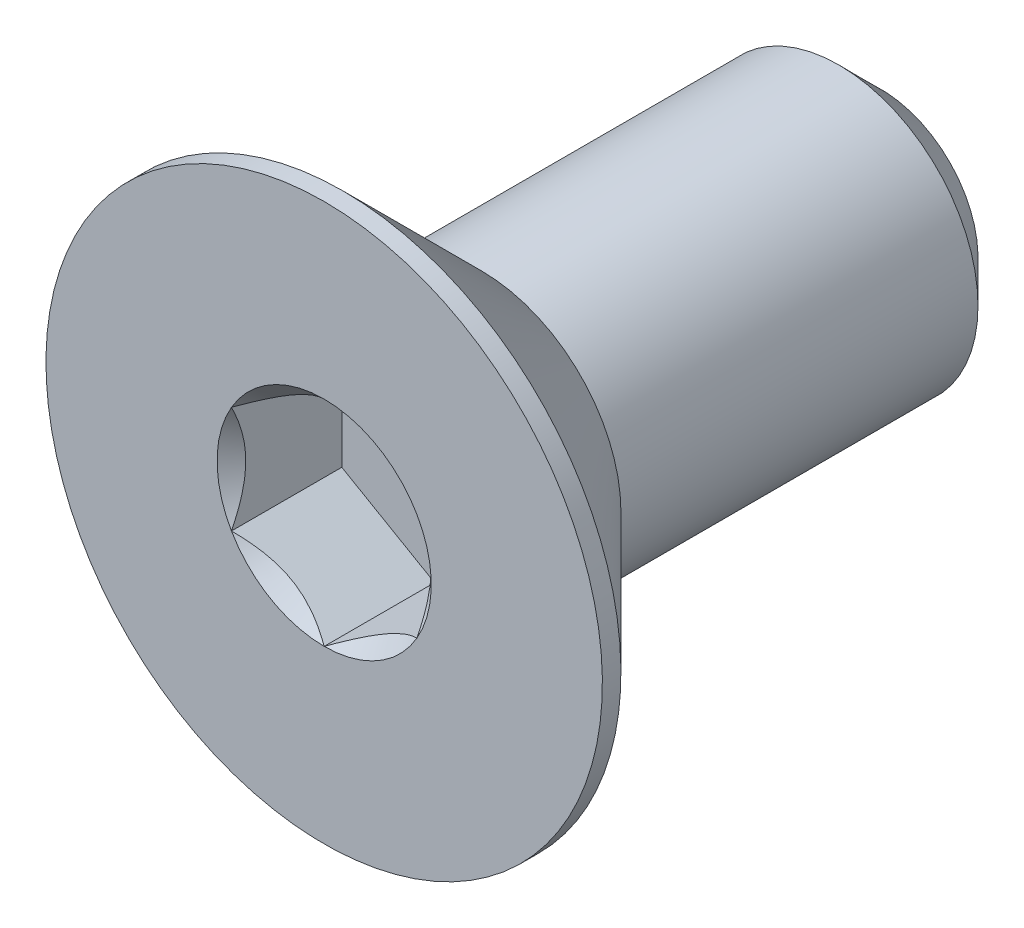
ISO-10303-21;
HEADER;
FILE_DESCRIPTION(('STEP AP214'),'2;1');
FILE_NAME('part.step','',(''),(''),'','','');
FILE_SCHEMA(('AUTOMOTIVE_DESIGN { 1 0 10303 214 1 1 1 1 }'));
ENDSEC;
DATA;
#1=APPLICATION_CONTEXT('core data for automotive mechanical design processes');
#2=APPLICATION_PROTOCOL_DEFINITION('international standard','automotive_design',2000,#1);
#3=PRODUCT_CONTEXT('',#1,'mechanical');
#4=PRODUCT('Part','Part','',(#3));
#5=PRODUCT_RELATED_PRODUCT_CATEGORY('part','',(#4));
#6=PRODUCT_DEFINITION_FORMATION('','',#4);
#7=PRODUCT_DEFINITION_CONTEXT('part definition',#1,'design');
#8=PRODUCT_DEFINITION('design','',#6,#7);
#9=PRODUCT_DEFINITION_SHAPE('','',#8);
#10=(LENGTH_UNIT() NAMED_UNIT(*) SI_UNIT(.MILLI.,.METRE.));
#11=(NAMED_UNIT(*) PLANE_ANGLE_UNIT() SI_UNIT($,.RADIAN.));
#12=(NAMED_UNIT(*) SI_UNIT($,.STERADIAN.) SOLID_ANGLE_UNIT());
#13=UNCERTAINTY_MEASURE_WITH_UNIT(LENGTH_MEASURE(1.E-05),#10,'distance_accuracy_value','');
#14=(GEOMETRIC_REPRESENTATION_CONTEXT(3) GLOBAL_UNCERTAINTY_ASSIGNED_CONTEXT((#13)) GLOBAL_UNIT_ASSIGNED_CONTEXT((#10,
#11,#12)) REPRESENTATION_CONTEXT('',''));
#15=CARTESIAN_POINT('',(0.,0.,0.));
#16=DIRECTION('',(0.,0.,1.));
#17=DIRECTION('',(1.,0.,0.));
#18=AXIS2_PLACEMENT_3D('',#15,#16,#17);
#19=CARTESIAN_POINT('',(0.,0.,-3.));
#20=DIRECTION('',(0.,0.,-1.));
#21=DIRECTION('',(0.,1.,0.));
#22=AXIS2_PLACEMENT_3D('',#19,#20,#21);
#23=CYLINDRICAL_SURFACE('',#22,1.5);
#24=CARTESIAN_POINT('',(0.,0.,1.3));
#25=DIRECTION('',(0.,0.,-1.));
#26=DIRECTION('',(0.,1.,0.));
#27=AXIS2_PLACEMENT_3D('',#24,#25,#26);
#28=CIRCLE('',#27,1.5);
#29=CARTESIAN_POINT('',(0.,1.5,1.3));
#30=VERTEX_POINT('',#29);
#31=EDGE_CURVE('E11',#30,#30,#28,.F.);
#32=ORIENTED_EDGE('',*,*,#31,.F.);
#33=EDGE_LOOP('',(#32));
#34=FACE_BOUND('',#33,.T.);
#35=CARTESIAN_POINT('',(0.,0.,-2.55));
#36=DIRECTION('',(0.,0.,-1.));
#37=DIRECTION('',(0.,1.,0.));
#38=AXIS2_PLACEMENT_3D('',#35,#36,#37);
#39=CIRCLE('',#38,1.5);
#40=CARTESIAN_POINT('',(0.,-1.5,-2.55));
#41=VERTEX_POINT('',#40);
#42=EDGE_CURVE('E43',#41,#41,#39,.F.);
#43=ORIENTED_EDGE('',*,*,#42,.T.);
#44=EDGE_LOOP('',(#43));
#45=FACE_BOUND('',#44,.T.);
#46=ADVANCED_FACE('F35',(#34,#45),#23,.T.);
#47=CARTESIAN_POINT('',(0.,1.5,-3.));
#48=DIRECTION('',(0.,0.,-1.));
#49=DIRECTION('',(0.,1.,0.));
#50=AXIS2_PLACEMENT_3D('',#47,#48,#49);
#51=PLANE('',#50);
#52=CARTESIAN_POINT('',(0.,0.,-3.));
#53=DIRECTION('',(0.,0.,-1.));
#54=DIRECTION('',(0.,1.,0.));
#55=AXIS2_PLACEMENT_3D('',#52,#53,#54);
#56=CIRCLE('',#55,1.05);
#57=CARTESIAN_POINT('',(0.,-1.05,-3.));
#58=VERTEX_POINT('',#57);
#59=EDGE_CURVE('E147',#58,#58,#56,.T.);
#60=ORIENTED_EDGE('',*,*,#59,.T.);
#61=EDGE_LOOP('',(#60));
#62=FACE_BOUND('',#61,.T.);
#63=ADVANCED_FACE('F156',(#62),#51,.T.);
#64=CARTESIAN_POINT('',(0.,0.,-3.));
#65=DIRECTION('',(0.,0.,1.));
#66=DIRECTION('',(0.,-1.,0.));
#67=AXIS2_PLACEMENT_3D('',#64,#65,#66);
#68=CONICAL_SURFACE('',#67,1.05,0.785398163397447);
#69=CARTESIAN_POINT('',(0.,-1.5,-2.55));
#70=CARTESIAN_POINT('',(0.,-1.4953125,-2.5546875));
#71=CARTESIAN_POINT('',(0.,-1.490625,-2.559375));
#72=CARTESIAN_POINT('',(0.,-1.48125,-2.56875));
#73=CARTESIAN_POINT('',(0.,-1.4765625,-2.5734375));
#74=CARTESIAN_POINT('',(0.,-1.4671875,-2.5828125));
#75=CARTESIAN_POINT('',(0.,-1.4625,-2.5875));
#76=CARTESIAN_POINT('',(0.,-1.453125,-2.596875));
#77=CARTESIAN_POINT('',(0.,-1.4484375,-2.6015625));
#78=CARTESIAN_POINT('',(0.,-1.4390625,-2.6109375));
#79=CARTESIAN_POINT('',(0.,-1.434375,-2.615625));
#80=CARTESIAN_POINT('',(0.,-1.425,-2.625));
#81=CARTESIAN_POINT('',(0.,-1.4203125,-2.6296875));
#82=CARTESIAN_POINT('',(0.,-1.4109375,-2.6390625));
#83=CARTESIAN_POINT('',(0.,-1.40625,-2.64375));
#84=CARTESIAN_POINT('',(0.,-1.396875,-2.653125));
#85=CARTESIAN_POINT('',(0.,-1.3921875,-2.6578125));
#86=CARTESIAN_POINT('',(0.,-1.3828125,-2.6671875));
#87=CARTESIAN_POINT('',(0.,-1.378125,-2.671875));
#88=CARTESIAN_POINT('',(0.,-1.36875,-2.68125));
#89=CARTESIAN_POINT('',(0.,-1.3640625,-2.6859375));
#90=CARTESIAN_POINT('',(0.,-1.3546875,-2.6953125));
#91=CARTESIAN_POINT('',(0.,-1.35,-2.7));
#92=CARTESIAN_POINT('',(0.,-1.340625,-2.709375));
#93=CARTESIAN_POINT('',(0.,-1.3359375,-2.7140625));
#94=CARTESIAN_POINT('',(0.,-1.3265625,-2.7234375));
#95=CARTESIAN_POINT('',(0.,-1.321875,-2.728125));
#96=CARTESIAN_POINT('',(0.,-1.3125,-2.7375));
#97=CARTESIAN_POINT('',(0.,-1.3078125,-2.7421875));
#98=CARTESIAN_POINT('',(0.,-1.2984375,-2.7515625));
#99=CARTESIAN_POINT('',(0.,-1.29375,-2.75625));
#100=CARTESIAN_POINT('',(0.,-1.284375,-2.765625));
#101=CARTESIAN_POINT('',(0.,-1.2796875,-2.7703125));
#102=CARTESIAN_POINT('',(0.,-1.2703125,-2.7796875));
#103=CARTESIAN_POINT('',(0.,-1.265625,-2.784375));
#104=CARTESIAN_POINT('',(0.,-1.25625,-2.79375));
#105=CARTESIAN_POINT('',(0.,-1.2515625,-2.7984375));
#106=CARTESIAN_POINT('',(0.,-1.2421875,-2.8078125));
#107=CARTESIAN_POINT('',(0.,-1.2375,-2.8125));
#108=CARTESIAN_POINT('',(0.,-1.228125,-2.821875));
#109=CARTESIAN_POINT('',(0.,-1.2234375,-2.8265625));
#110=CARTESIAN_POINT('',(0.,-1.2140625,-2.8359375));
#111=CARTESIAN_POINT('',(0.,-1.209375,-2.840625));
#112=CARTESIAN_POINT('',(0.,-1.2,-2.85));
#113=CARTESIAN_POINT('',(0.,-1.1953125,-2.8546875));
#114=CARTESIAN_POINT('',(0.,-1.1859375,-2.8640625));
#115=CARTESIAN_POINT('',(0.,-1.18125,-2.86875));
#116=CARTESIAN_POINT('',(0.,-1.171875,-2.878125));
#117=CARTESIAN_POINT('',(0.,-1.1671875,-2.8828125));
#118=CARTESIAN_POINT('',(0.,-1.1578125,-2.8921875));
#119=CARTESIAN_POINT('',(0.,-1.153125,-2.896875));
#120=CARTESIAN_POINT('',(0.,-1.14375,-2.90625));
#121=CARTESIAN_POINT('',(0.,-1.1390625,-2.9109375));
#122=CARTESIAN_POINT('',(0.,-1.1296875,-2.9203125));
#123=CARTESIAN_POINT('',(0.,-1.125,-2.925));
#124=CARTESIAN_POINT('',(0.,-1.115625,-2.934375));
#125=CARTESIAN_POINT('',(0.,-1.1109375,-2.9390625));
#126=CARTESIAN_POINT('',(0.,-1.1015625,-2.9484375));
#127=CARTESIAN_POINT('',(0.,-1.096875,-2.953125));
#128=CARTESIAN_POINT('',(0.,-1.0875,-2.9625));
#129=CARTESIAN_POINT('',(0.,-1.0828125,-2.9671875));
#130=CARTESIAN_POINT('',(0.,-1.0734375,-2.9765625));
#131=CARTESIAN_POINT('',(0.,-1.06875,-2.98125));
#132=CARTESIAN_POINT('',(0.,-1.059375,-2.990625));
#133=CARTESIAN_POINT('',(0.,-1.0546875,-2.9953125));
#134=CARTESIAN_POINT('',(0.,-1.05,-3.));
#135=B_SPLINE_CURVE_WITH_KNOTS('',3,(#69,#70,#71,#72,#73,#74,#75,#76,#77,#78,#79,#80,#81,#82,
#83,#84,#85,#86,#87,#88,#89,#90,#91,#92,#93,#94,#95,#96,#97,#98,#99,#100,#101,#102,#103,#104,
#105,#106,#107,#108,#109,#110,#111,#112,#113,#114,#115,#116,#117,#118,#119,#120,#121,#122,#123,
#124,#125,#126,#127,#128,#129,#130,#131,#132,#133,#134),.UNSPECIFIED.,.F.,.F.,(4,2,2,2,2,2,2,2,
2,2,2,2,2,2,2,2,2,2,2,2,2,2,2,2,2,2,2,2,2,2,2,2,4),(0.,0.0198873782208715,0.0397747564417434,
0.0596621346626151,0.079549512883487,0.0994368911043588,0.119324269325231,0.139211647546102,
0.159099025766974,0.178986403987846,0.198873782208718,0.218761160429589,0.238648538650461,
0.258535916871333,0.278423295092205,0.298310673313076,0.318198051533948,0.33808542975482,
0.357972807975692,0.377860186196563,0.397747564417435,0.417634942638307,0.437522320859179,
0.457409699080051,0.477297077300922,0.497184455521794,0.517071833742666,0.536959211963538,
0.556846590184409,0.576733968405281,0.596621346626153,0.616508724847025,0.636396103067896),.UNSPECIFIED.);
#136=EDGE_CURVE('BSEAM37',#41,#58,#135,.T.);
#137=ORIENTED_EDGE('',*,*,#42,.F.);
#138=ORIENTED_EDGE('',*,*,#59,.F.);
#139=ORIENTED_EDGE('',*,*,#136,.T.);
#140=ORIENTED_EDGE('',*,*,#136,.F.);
#141=EDGE_LOOP('',(#137,#139,#138,#140));
#142=FACE_BOUND('',#141,.T.);
#143=ADVANCED_FACE('F37',(#142),#68,.T.);
#144=CARTESIAN_POINT('',(0.,0.,-3.));
#145=DIRECTION('',(0.,0.,-1.));
#146=DIRECTION('',(0.,1.,0.));
#147=AXIS2_PLACEMENT_3D('',#144,#145,#146);
#148=CYLINDRICAL_SURFACE('',#147,3.);
#149=CARTESIAN_POINT('',(0.,0.,3.));
#150=DIRECTION('',(0.,0.,-1.));
#151=DIRECTION('',(0.,1.,0.));
#152=AXIS2_PLACEMENT_3D('',#149,#150,#151);
#153=CIRCLE('',#152,3.);
#154=CARTESIAN_POINT('',(0.,3.,3.));
#155=VERTEX_POINT('',#154);
#156=EDGE_CURVE('E127',#155,#155,#153,.T.);
#157=ORIENTED_EDGE('',*,*,#156,.T.);
#158=EDGE_LOOP('',(#157));
#159=FACE_BOUND('',#158,.T.);
#160=CARTESIAN_POINT('',(0.,0.,2.79999999999999));
#161=DIRECTION('',(0.,0.,-1.));
#162=DIRECTION('',(0.,1.,0.));
#163=AXIS2_PLACEMENT_3D('',#160,#161,#162);
#164=CIRCLE('',#163,3.);
#165=CARTESIAN_POINT('',(0.,3.,2.79999999999999));
#166=VERTEX_POINT('',#165);
#167=EDGE_CURVE('E124',#166,#166,#164,.T.);
#168=ORIENTED_EDGE('',*,*,#167,.F.);
#169=EDGE_LOOP('',(#168));
#170=FACE_BOUND('',#169,.T.);
#171=ADVANCED_FACE('F155',(#159,#170),#148,.T.);
#172=CARTESIAN_POINT('',(0.,0.,1.3));
#173=DIRECTION('',(0.,0.,1.));
#174=DIRECTION('',(0.,-1.,0.));
#175=AXIS2_PLACEMENT_3D('',#172,#173,#174);
#176=CONICAL_SURFACE('',#175,1.5,0.78539816339745);
#177=ORIENTED_EDGE('',*,*,#167,.T.);
#178=EDGE_LOOP('',(#177));
#179=FACE_BOUND('',#178,.T.);
#180=ORIENTED_EDGE('',*,*,#31,.T.);
#181=EDGE_LOOP('',(#180));
#182=FACE_BOUND('',#181,.T.);
#183=ADVANCED_FACE('F169',(#179,#182),#176,.T.);
#184=CARTESIAN_POINT('',(0.,0.,3.));
#185=DIRECTION('',(0.,0.,1.));
#186=DIRECTION('',(0.,-1.,0.));
#187=AXIS2_PLACEMENT_3D('',#184,#185,#186);
#188=PLANE('',#187);
#189=CARTESIAN_POINT('',(0.,0.,3.));
#190=DIRECTION('',(0.,0.,1.));
#191=DIRECTION('',(1.,0.,0.));
#192=AXIS2_PLACEMENT_3D('',#189,#190,#191);
#193=CIRCLE('',#192,1.15470053837925);
#194=CARTESIAN_POINT('',(1.,0.577350269189632,3.));
#195=VERTEX_POINT('',#194);
#196=CARTESIAN_POINT('',(0.,1.15470053837926,3.));
#197=VERTEX_POINT('',#196);
#198=EDGE_CURVE('E94',#195,#197,#193,.T.);
#199=ORIENTED_EDGE('',*,*,#198,.F.);
#200=CARTESIAN_POINT('',(0.,0.,3.));
#201=DIRECTION('',(0.,0.,1.));
#202=DIRECTION('',(1.,0.,0.));
#203=AXIS2_PLACEMENT_3D('',#200,#201,#202);
#204=CIRCLE('',#203,1.15470053837925);
#205=CARTESIAN_POINT('',(0.999999999999989,-0.577350269189633,3.));
#206=VERTEX_POINT('',#205);
#207=EDGE_CURVE('E106',#206,#195,#204,.T.);
#208=ORIENTED_EDGE('',*,*,#207,.F.);
#209=CARTESIAN_POINT('',(0.,0.,3.));
#210=DIRECTION('',(0.,0.,1.));
#211=DIRECTION('',(1.,0.,0.));
#212=AXIS2_PLACEMENT_3D('',#209,#210,#211);
#213=CIRCLE('',#212,1.15470053837925);
#214=CARTESIAN_POINT('',(0.,-1.15470053837924,3.));
#215=VERTEX_POINT('',#214);
#216=EDGE_CURVE('E240',#215,#206,#213,.T.);
#217=ORIENTED_EDGE('',*,*,#216,.F.);
#218=CARTESIAN_POINT('',(0.,0.,3.));
#219=DIRECTION('',(0.,0.,1.));
#220=DIRECTION('',(1.,0.,0.));
#221=AXIS2_PLACEMENT_3D('',#218,#219,#220);
#222=CIRCLE('',#221,1.15470053837925);
#223=CARTESIAN_POINT('',(-1.,-0.577350269189614,3.));
#224=VERTEX_POINT('',#223);
#225=EDGE_CURVE('E119',#224,#215,#222,.T.);
#226=ORIENTED_EDGE('',*,*,#225,.F.);
#227=CARTESIAN_POINT('',(0.,0.,3.));
#228=DIRECTION('',(0.,0.,1.));
#229=DIRECTION('',(1.,0.,0.));
#230=AXIS2_PLACEMENT_3D('',#227,#228,#229);
#231=CIRCLE('',#230,1.15470053837925);
#232=CARTESIAN_POINT('',(-1.,0.577350269189624,3.));
#233=VERTEX_POINT('',#232);
#234=EDGE_CURVE('E241',#233,#224,#231,.T.);
#235=ORIENTED_EDGE('',*,*,#234,.F.);
#236=CARTESIAN_POINT('',(0.,0.,3.));
#237=DIRECTION('',(0.,0.,1.));
#238=DIRECTION('',(1.,0.,0.));
#239=AXIS2_PLACEMENT_3D('',#236,#237,#238);
#240=CIRCLE('',#239,1.15470053837925);
#241=EDGE_CURVE('E109',#197,#233,#240,.T.);
#242=ORIENTED_EDGE('',*,*,#241,.F.);
#243=EDGE_LOOP('',(#199,#208,#217,#226,#235,#242));
#244=FACE_BOUND('',#243,.T.);
#245=ORIENTED_EDGE('',*,*,#156,.F.);
#246=EDGE_LOOP('',(#245));
#247=FACE_BOUND('',#246,.T.);
#248=ADVANCED_FACE('F103',(#244,#247),#188,.T.);
#249=CARTESIAN_POINT('',(1.,0.577350269189626,1.81));
#250=DIRECTION('',(0.5,0.866025403784438,0.));
#251=DIRECTION('',(-0.866025403784439,0.5,0.));
#252=AXIS2_PLACEMENT_3D('',#249,#250,#251);
#253=PLANE('',#252);
#254=DIRECTION('',(0.,0.,1.));
#255=VECTOR('',#254,1.);
#256=CARTESIAN_POINT('',(1.,0.577350269189626,1.81));
#257=LINE('',#256,#255);
#258=CARTESIAN_POINT('',(1.,0.577350269189626,1.81));
#259=VERTEX_POINT('',#258);
#260=EDGE_CURVE('E50',#259,#195,#257,.T.);
#261=ORIENTED_EDGE('',*,*,#260,.T.);
#262=CARTESIAN_POINT('',(-0.000199999999999771,1.15481600843309,3.00011548737261));
#263=CARTESIAN_POINT('',(0.0341825950071806,1.13496520795026,2.98027793082573));
#264=CARTESIAN_POINT('',(0.0691401181398245,1.11478247255942,2.96160502063888));
#265=CARTESIAN_POINT('',(0.140422802956089,1.07362739529219,2.92741474272315));
#266=CARTESIAN_POINT('',(0.176754750528983,1.0526511355808,2.91191640902345));
#267=CARTESIAN_POINT('',(0.25001661380331,1.01035337909803,2.88536730714226));
#268=CARTESIAN_POINT('',(0.286927851445413,0.989042666109242,2.87424977399692));
#269=CARTESIAN_POINT('',(0.361562729310857,0.945952199282693,2.85711986577618));
#270=CARTESIAN_POINT('',(0.399284088108633,0.924173762626598,2.85109469746667));
#271=CARTESIAN_POINT('',(0.464292198417931,0.886641312640017,2.84566055496749));
#272=CARTESIAN_POINT('',(0.491494371528169,0.870936130672278,2.84485693831673));
#273=CARTESIAN_POINT('',(0.545846040669108,0.839556179862851,2.84620669941688));
#274=CARTESIAN_POINT('',(0.572995523754872,0.823881418494926,2.84836072954719));
#275=CARTESIAN_POINT('',(0.654056277326956,0.77708097059937,2.85911697212847));
#276=CARTESIAN_POINT('',(0.707564140978423,0.746188191116433,2.87201455641535));
#277=CARTESIAN_POINT('',(0.801476065143427,0.691968116419652,2.90314073060217));
#278=CARTESIAN_POINT('',(0.842320523671831,0.668386557293374,2.91973779770183));
#279=CARTESIAN_POINT('',(0.922409637381942,0.622147085933683,2.95712492468529));
#280=CARTESIAN_POINT('',(0.961659010870436,0.599486449584576,2.9779013418174));
#281=CARTESIAN_POINT('',(1.0002,0.577234799135789,3.00011548737261));
#282=B_SPLINE_CURVE_WITH_KNOTS('',3,(#262,#263,#264,#265,#266,#267,#268,#269,#270,#271,#272,
#273,#274,#275,#276,#277,#278,#279,#280,#281),.UNSPECIFIED.,.F.,.F.,(4,2,2,2,2,2,2,2,2,4),(0.,
0.133237676828558,0.267252229834488,0.399137076269297,0.530689603280765,0.624814864263842,
0.718960890149128,0.907306626112091,1.05710100361789,1.20641411519286),.UNSPECIFIED.);
#283=EDGE_CURVE('E91',#197,#195,#282,.T.);
#284=ORIENTED_EDGE('',*,*,#283,.F.);
#285=DIRECTION('',(0.,0.,1.));
#286=VECTOR('',#285,1.);
#287=CARTESIAN_POINT('',(0.,1.15470053837925,1.81));
#288=LINE('',#287,#286);
#289=CARTESIAN_POINT('',(0.,1.15470053837925,1.81));
#290=VERTEX_POINT('',#289);
#291=EDGE_CURVE('E143',#290,#197,#288,.T.);
#292=ORIENTED_EDGE('',*,*,#291,.F.);
#293=DIRECTION('',(-0.866025403784439,0.5,0.));
#294=VECTOR('',#293,1.);
#295=CARTESIAN_POINT('',(1.,0.577350269189626,1.81));
#296=LINE('',#295,#294);
#297=EDGE_CURVE('E116',#259,#290,#296,.T.);
#298=ORIENTED_EDGE('',*,*,#297,.F.);
#299=EDGE_LOOP('',(#261,#284,#292,#298));
#300=FACE_BOUND('',#299,.T.);
#301=ADVANCED_FACE('F121',(#300),#253,.F.);
#302=CARTESIAN_POINT('',(1.,-0.577350269189627,1.81));
#303=DIRECTION('',(1.,0.,0.));
#304=DIRECTION('',(0.,0.,-1.));
#305=AXIS2_PLACEMENT_3D('',#302,#303,#304);
#306=PLANE('',#305);
#307=DIRECTION('',(0.,0.,1.));
#308=VECTOR('',#307,1.);
#309=CARTESIAN_POINT('',(1.,-0.577350269189627,1.81));
#310=LINE('',#309,#308);
#311=CARTESIAN_POINT('',(1.,-0.577350269189627,1.81));
#312=VERTEX_POINT('',#311);
#313=EDGE_CURVE('E58',#312,#206,#310,.T.);
#314=ORIENTED_EDGE('',*,*,#313,.T.);
#315=CARTESIAN_POINT('',(1.,-1.15147208646462,3.37038567751387));
#316=CARTESIAN_POINT('',(1.,-1.12343447988553,3.34921991987372));
#317=CARTESIAN_POINT('',(1.,-1.09524064850698,3.32826169217592));
#318=CARTESIAN_POINT('',(1.,-1.03847715644377,3.28684602223563));
#319=CARTESIAN_POINT('',(1.,-1.00990740382976,3.26638870612367));
#320=CARTESIAN_POINT('',(1.,-0.923120894333482,3.20560479495452));
#321=CARTESIAN_POINT('',(1.,-0.864253173759064,3.16619222896141));
#322=CARTESIAN_POINT('',(1.,-0.740809858258049,3.08882066420021));
#323=CARTESIAN_POINT('',(1.,-0.67610025513781,3.05107303911435));
#324=CARTESIAN_POINT('',(1.,-0.543448939049125,2.9820245875513));
#325=CARTESIAN_POINT('',(1.,-0.475519112027778,2.95070202784687));
#326=CARTESIAN_POINT('',(1.,-0.373555850333527,2.9123817788838));
#327=CARTESIAN_POINT('',(1.,-0.341031989670906,2.90138359164216));
#328=CARTESIAN_POINT('',(1.,-0.275199079052291,2.88199834214736));
#329=CARTESIAN_POINT('',(1.,-0.24188997517393,2.8736114597767));
#330=CARTESIAN_POINT('',(1.,-0.175247517042989,2.86002522071902));
#331=CARTESIAN_POINT('',(1.,-0.141925568218171,2.85477079076797));
#332=CARTESIAN_POINT('',(1.,-0.0749144362322747,2.84754868657089));
#333=CARTESIAN_POINT('',(1.,-0.0412251978501572,2.84558151361051));
#334=CARTESIAN_POINT('',(1.,0.0249580992634261,2.84508319839316));
#335=CARTESIAN_POINT('',(1.,0.0574512826460446,2.84643026788863));
#336=CARTESIAN_POINT('',(1.,0.122148505701872,2.85221648449898));
#337=CARTESIAN_POINT('',(1.,0.154352610132932,2.85665492066154));
#338=CARTESIAN_POINT('',(1.,0.218799898867646,2.8684568301452));
#339=CARTESIAN_POINT('',(1.,0.25103374326896,2.87587054103851));
#340=CARTESIAN_POINT('',(1.,0.314797132354926,2.89322894249868));
#341=CARTESIAN_POINT('',(1.,0.346326735731012,2.90317342128883));
#342=CARTESIAN_POINT('',(1.,0.445594187730212,2.93822348255434));
#343=CARTESIAN_POINT('',(1.,0.511919139476043,2.96732085835672));
#344=CARTESIAN_POINT('',(1.,0.641453244657538,3.0320153296865));
#345=CARTESIAN_POINT('',(1.,0.70465013312635,3.06763577671524));
#346=CARTESIAN_POINT('',(1.,0.825428490174992,3.14112390134693));
#347=CARTESIAN_POINT('',(1.,0.88313294786769,3.17879194713546));
#348=CARTESIAN_POINT('',(1.,0.96814885370457,3.23702285294316));
#349=CARTESIAN_POINT('',(1.,0.99612057038029,3.25663847576285));
#350=CARTESIAN_POINT('',(1.,1.05168177729902,3.29638851706127));
#351=CARTESIAN_POINT('',(1.,1.07927136997701,3.31652279219883));
#352=CARTESIAN_POINT('',(1.,1.1067018534633,3.33687211907297));
#353=B_SPLINE_CURVE_WITH_KNOTS('',3,(#315,#316,#317,#318,#319,#320,#321,#322,#323,#324,#325,
#326,#327,#328,#329,#330,#331,#332,#333,#334,#335,#336,#337,#338,#339,#340,#341,#342,#343,#344,
#345,#346,#347,#348,#349,#350,#351,#352),.UNSPECIFIED.,.F.,.F.,(4,2,2,2,2,2,2,2,2,2,2,2,2,2,2,2,
2,2,4),(0.,0.105386459083292,0.210799187330127,0.423233611565474,0.647793540908512,
0.871580877738622,0.974493074181434,1.07741235827203,1.17846428203206,1.27953161415764,
1.37694086739612,1.4743277258541,1.57343322804295,1.67253043972853,1.88917353996829,
2.10660791038815,2.31323734249845,2.41572589232046,2.51818641476505),.UNSPECIFIED.);
#354=EDGE_CURVE('E115',#195,#206,#353,.F.);
#355=ORIENTED_EDGE('',*,*,#354,.F.);
#356=ORIENTED_EDGE('',*,*,#260,.F.);
#357=DIRECTION('',(0.,1.,0.));
#358=VECTOR('',#357,1.);
#359=CARTESIAN_POINT('',(1.,-0.577350269189627,1.81));
#360=LINE('',#359,#358);
#361=EDGE_CURVE('E132',#312,#259,#360,.T.);
#362=ORIENTED_EDGE('',*,*,#361,.F.);
#363=EDGE_LOOP('',(#314,#355,#356,#362));
#364=FACE_BOUND('',#363,.T.);
#365=ADVANCED_FACE('F118',(#364),#306,.F.);
#366=CARTESIAN_POINT('',(0.,-1.15470053837925,1.81));
#367=DIRECTION('',(0.5,-0.866025403784439,0.));
#368=DIRECTION('',(0.866025403784439,0.5,0.));
#369=AXIS2_PLACEMENT_3D('',#366,#367,#368);
#370=PLANE('',#369);
#371=DIRECTION('',(0.,0.,1.));
#372=VECTOR('',#371,1.);
#373=CARTESIAN_POINT('',(0.,-1.15470053837925,1.81));
#374=LINE('',#373,#372);
#375=CARTESIAN_POINT('',(0.,-1.15470053837925,1.81));
#376=VERTEX_POINT('',#375);
#377=EDGE_CURVE('E129',#376,#215,#374,.T.);
#378=ORIENTED_EDGE('',*,*,#377,.T.);
#379=CARTESIAN_POINT('',(1.0002,-0.577234799135789,3.00011548737262));
#380=CARTESIAN_POINT('',(0.965817404992819,-0.597085599618622,2.98027793082574));
#381=CARTESIAN_POINT('',(0.930859881860175,-0.617268335009457,2.9616050206389));
#382=CARTESIAN_POINT('',(0.859577197043911,-0.658423412276686,2.92741474272317));
#383=CARTESIAN_POINT('',(0.823245249471016,-0.67939967198808,2.91191640902347));
#384=CARTESIAN_POINT('',(0.74998338619669,-0.721697428470846,2.88536730714227));
#385=CARTESIAN_POINT('',(0.713072148554587,-0.743008141459637,2.87424977399693));
#386=CARTESIAN_POINT('',(0.638437270689143,-0.786098608286186,2.85711986577619));
#387=CARTESIAN_POINT('',(0.600715911891366,-0.80787704494228,2.85109469746668));
#388=CARTESIAN_POINT('',(0.535707801582069,-0.845409494928862,2.8456605549675));
#389=CARTESIAN_POINT('',(0.50850562847183,-0.861114676896601,2.84485693831674));
#390=CARTESIAN_POINT('',(0.45415395933089,-0.892494627706028,2.8462066994169));
#391=CARTESIAN_POINT('',(0.427004476245126,-0.908169389073953,2.84836072954721));
#392=CARTESIAN_POINT('',(0.345943722673041,-0.95496983696951,2.85911697212848));
#393=CARTESIAN_POINT('',(0.292435859021573,-0.985862616452447,2.87201455641537));
#394=CARTESIAN_POINT('',(0.198523934856568,-1.04008269114923,2.90314073060219));
#395=CARTESIAN_POINT('',(0.157679476328166,-1.06366425027551,2.91973779770185));
#396=CARTESIAN_POINT('',(0.0775903626180562,-1.1099037216352,2.9571249246853));
#397=CARTESIAN_POINT('',(0.0383409891295622,-1.1325643579843,2.97790134181741));
#398=CARTESIAN_POINT('',(-0.00019999999999996,-1.15481600843309,3.00011548737262));
#399=B_SPLINE_CURVE_WITH_KNOTS('',3,(#379,#380,#381,#382,#383,#384,#385,#386,#387,#388,#389,
#390,#391,#392,#393,#394,#395,#396,#397,#398),.UNSPECIFIED.,.F.,.F.,(4,2,2,2,2,2,2,2,2,4),(0.,
0.133237676828558,0.267252229834488,0.399137076269297,0.530689603280764,0.624814864263842,
0.71896089014913,0.907306626112096,1.05710100361789,1.20641411519286),.UNSPECIFIED.);
#400=EDGE_CURVE('E238',#206,#215,#399,.T.);
#401=ORIENTED_EDGE('',*,*,#400,.F.);
#402=ORIENTED_EDGE('',*,*,#313,.F.);
#403=DIRECTION('',(0.866025403784439,0.5,0.));
#404=VECTOR('',#403,1.);
#405=CARTESIAN_POINT('',(0.,-1.15470053837925,1.81));
#406=LINE('',#405,#404);
#407=EDGE_CURVE('E230',#376,#312,#406,.T.);
#408=ORIENTED_EDGE('',*,*,#407,.F.);
#409=EDGE_LOOP('',(#378,#401,#402,#408));
#410=FACE_BOUND('',#409,.T.);
#411=ADVANCED_FACE('F195',(#410),#370,.F.);
#412=CARTESIAN_POINT('',(-1.,-0.577350269189626,1.81));
#413=DIRECTION('',(-0.5,-0.866025403784439,0.));
#414=DIRECTION('',(0.866025403784439,-0.5,0.));
#415=AXIS2_PLACEMENT_3D('',#412,#413,#414);
#416=PLANE('',#415);
#417=DIRECTION('',(0.,0.,1.));
#418=VECTOR('',#417,1.);
#419=CARTESIAN_POINT('',(-1.,-0.577350269189626,1.81));
#420=LINE('',#419,#418);
#421=CARTESIAN_POINT('',(-1.,-0.577350269189626,1.81));
#422=VERTEX_POINT('',#421);
#423=EDGE_CURVE('E137',#422,#224,#420,.T.);
#424=ORIENTED_EDGE('',*,*,#423,.T.);
#425=CARTESIAN_POINT('',(0.000199999999999887,-1.15481600843309,3.00011548737262));
#426=CARTESIAN_POINT('',(-0.0341825950071811,-1.13496520795026,2.98027793082574));
#427=CARTESIAN_POINT('',(-0.0691401181398256,-1.11478247255942,2.9616050206389));
#428=CARTESIAN_POINT('',(-0.140422802956091,-1.07362739529219,2.92741474272317));
#429=CARTESIAN_POINT('',(-0.176754750528986,-1.0526511355808,2.91191640902347));
#430=CARTESIAN_POINT('',(-0.250016613803313,-1.01035337909803,2.88536730714227));
#431=CARTESIAN_POINT('',(-0.286927851445417,-0.989042666109239,2.87424977399694));
#432=CARTESIAN_POINT('',(-0.361562729310862,-0.945952199282689,2.85711986577619));
#433=CARTESIAN_POINT('',(-0.399284088108639,-0.924173762626594,2.85109469746668));
#434=CARTESIAN_POINT('',(-0.464292198417938,-0.886641312640012,2.8456605549675));
#435=CARTESIAN_POINT('',(-0.491494371528176,-0.870936130672273,2.84485693831674));
#436=CARTESIAN_POINT('',(-0.545846040669117,-0.839556179862846,2.8462066994169));
#437=CARTESIAN_POINT('',(-0.572995523754881,-0.823881418494921,2.84836072954721));
#438=CARTESIAN_POINT('',(-0.654056277326966,-0.777080970599363,2.85911697212848));
#439=CARTESIAN_POINT('',(-0.707564140978433,-0.746188191116427,2.87201455641537));
#440=CARTESIAN_POINT('',(-0.801476065143437,-0.691968116419646,2.90314073060219));
#441=CARTESIAN_POINT('',(-0.842320523671839,-0.668386557293369,2.91973779770185));
#442=CARTESIAN_POINT('',(-0.922409637381946,-0.62214708593368,2.9571249246853));
#443=CARTESIAN_POINT('',(-0.961659010870439,-0.599486449584575,2.97790134181741));
#444=CARTESIAN_POINT('',(-1.0002,-0.577234799135788,3.00011548737262));
#445=B_SPLINE_CURVE_WITH_KNOTS('',3,(#425,#426,#427,#428,#429,#430,#431,#432,#433,#434,#435,
#436,#437,#438,#439,#440,#441,#442,#443,#444),.UNSPECIFIED.,.F.,.F.,(4,2,2,2,2,2,2,2,2,4),(0.,
0.13323767682856,0.267252229834492,0.399137076269303,0.530689603280773,0.624814864263851,
0.718960890149139,0.907306626112105,1.0571010036179,1.20641411519286),.UNSPECIFIED.);
#446=EDGE_CURVE('E212',#215,#224,#445,.T.);
#447=ORIENTED_EDGE('',*,*,#446,.F.);
#448=ORIENTED_EDGE('',*,*,#377,.F.);
#449=DIRECTION('',(0.866025403784439,-0.5,0.));
#450=VECTOR('',#449,1.);
#451=CARTESIAN_POINT('',(-1.,-0.577350269189626,1.81));
#452=LINE('',#451,#450);
#453=EDGE_CURVE('E228',#422,#376,#452,.T.);
#454=ORIENTED_EDGE('',*,*,#453,.F.);
#455=EDGE_LOOP('',(#424,#447,#448,#454));
#456=FACE_BOUND('',#455,.T.);
#457=ADVANCED_FACE('F191',(#456),#416,.F.);
#458=CARTESIAN_POINT('',(-1.,0.577350269189626,1.81));
#459=DIRECTION('',(-1.,0.,0.));
#460=DIRECTION('',(0.,-1.,0.));
#461=AXIS2_PLACEMENT_3D('',#458,#459,#460);
#462=PLANE('',#461);
#463=DIRECTION('',(0.,0.,1.));
#464=VECTOR('',#463,1.);
#465=CARTESIAN_POINT('',(-1.,0.577350269189626,1.81));
#466=LINE('',#465,#464);
#467=CARTESIAN_POINT('',(-1.,0.577350269189626,1.81));
#468=VERTEX_POINT('',#467);
#469=EDGE_CURVE('E140',#468,#233,#466,.T.);
#470=ORIENTED_EDGE('',*,*,#469,.T.);
#471=CARTESIAN_POINT('',(-1.,-1.15147208646462,3.37038567751387));
#472=CARTESIAN_POINT('',(-1.,-1.12343447988552,3.34921991987372));
#473=CARTESIAN_POINT('',(-1.,-1.09524064850698,3.32826169217592));
#474=CARTESIAN_POINT('',(-1.,-1.03847715644377,3.28684602223563));
#475=CARTESIAN_POINT('',(-1.,-1.00990740382975,3.26638870612367));
#476=CARTESIAN_POINT('',(-1.,-0.923120894333481,3.20560479495452));
#477=CARTESIAN_POINT('',(-1.,-0.864253173759063,3.16619222896141));
#478=CARTESIAN_POINT('',(-1.,-0.740809858258047,3.08882066420021));
#479=CARTESIAN_POINT('',(-1.,-0.676100255137808,3.05107303911435));
#480=CARTESIAN_POINT('',(-1.,-0.543448939049124,2.9820245875513));
#481=CARTESIAN_POINT('',(-1.,-0.475519112027777,2.95070202784687));
#482=CARTESIAN_POINT('',(-1.,-0.373555850333526,2.9123817788838));
#483=CARTESIAN_POINT('',(-1.,-0.341031989670905,2.90138359164216));
#484=CARTESIAN_POINT('',(-1.,-0.27519907905229,2.88199834214736));
#485=CARTESIAN_POINT('',(-1.,-0.241889975173929,2.8736114597767));
#486=CARTESIAN_POINT('',(-1.,-0.175247517042989,2.86002522071902));
#487=CARTESIAN_POINT('',(-1.,-0.141925568218171,2.85477079076797));
#488=CARTESIAN_POINT('',(-1.,-0.0749144362322744,2.84754868657089));
#489=CARTESIAN_POINT('',(-1.,-0.0412251978501569,2.84558151361051));
#490=CARTESIAN_POINT('',(-1.,0.0249580992634263,2.84508319839316));
#491=CARTESIAN_POINT('',(-1.,0.0574512826460448,2.84643026788864));
#492=CARTESIAN_POINT('',(-1.,0.122148505701873,2.85221648449899));
#493=CARTESIAN_POINT('',(-1.,0.154352610132933,2.85665492066154));
#494=CARTESIAN_POINT('',(-1.,0.218799898867646,2.8684568301452));
#495=CARTESIAN_POINT('',(-1.,0.25103374326896,2.87587054103851));
#496=CARTESIAN_POINT('',(-1.,0.314797132354926,2.89322894249868));
#497=CARTESIAN_POINT('',(-1.,0.346326735731012,2.90317342128883));
#498=CARTESIAN_POINT('',(-1.,0.445594187730212,2.93822348255434));
#499=CARTESIAN_POINT('',(-1.,0.511919139476043,2.96732085835673));
#500=CARTESIAN_POINT('',(-1.,0.641453244657538,3.0320153296865));
#501=CARTESIAN_POINT('',(-1.,0.70465013312635,3.06763577671524));
#502=CARTESIAN_POINT('',(-1.,0.825428490174992,3.14112390134693));
#503=CARTESIAN_POINT('',(-1.,0.88313294786769,3.17879194713546));
#504=CARTESIAN_POINT('',(-1.,0.96814885370457,3.23702285294316));
#505=CARTESIAN_POINT('',(-1.,0.99612057038029,3.25663847576285));
#506=CARTESIAN_POINT('',(-1.,1.05168177729902,3.29638851706127));
#507=CARTESIAN_POINT('',(-1.,1.07927136997701,3.31652279219883));
#508=CARTESIAN_POINT('',(-1.,1.1067018534633,3.33687211907297));
#509=B_SPLINE_CURVE_WITH_KNOTS('',3,(#471,#472,#473,#474,#475,#476,#477,#478,#479,#480,#481,
#482,#483,#484,#485,#486,#487,#488,#489,#490,#491,#492,#493,#494,#495,#496,#497,#498,#499,#500,
#501,#502,#503,#504,#505,#506,#507,#508),.UNSPECIFIED.,.F.,.F.,(4,2,2,2,2,2,2,2,2,2,2,2,2,2,2,2,
2,2,4),(0.,0.105386459083292,0.210799187330127,0.423233611565474,0.647793540908512,
0.871580877738622,0.974493074181434,1.07741235827203,1.17846428203206,1.27953161415764,
1.37694086739612,1.47432772585409,1.57343322804295,1.67253043972853,1.88917353996829,
2.10660791038814,2.31323734249845,2.41572589232046,2.51818641476504),.UNSPECIFIED.);
#510=EDGE_CURVE('E97',#224,#233,#509,.T.);
#511=ORIENTED_EDGE('',*,*,#510,.F.);
#512=ORIENTED_EDGE('',*,*,#423,.F.);
#513=DIRECTION('',(0.,-1.,0.));
#514=VECTOR('',#513,1.);
#515=CARTESIAN_POINT('',(-1.,0.577350269189626,1.81));
#516=LINE('',#515,#514);
#517=EDGE_CURVE('E225',#468,#422,#516,.T.);
#518=ORIENTED_EDGE('',*,*,#517,.F.);
#519=EDGE_LOOP('',(#470,#511,#512,#518));
#520=FACE_BOUND('',#519,.T.);
#521=ADVANCED_FACE('F187',(#520),#462,.F.);
#522=CARTESIAN_POINT('',(0.,1.15470053837925,1.81));
#523=DIRECTION('',(-0.5,0.866025403784439,0.));
#524=DIRECTION('',(-0.866025403784439,-0.5,0.));
#525=AXIS2_PLACEMENT_3D('',#522,#523,#524);
#526=PLANE('',#525);
#527=ORIENTED_EDGE('',*,*,#291,.T.);
#528=CARTESIAN_POINT('',(-1.0002,0.577234799135788,3.00011548737261));
#529=CARTESIAN_POINT('',(-0.965817404992819,0.597085599618622,2.98027793082573));
#530=CARTESIAN_POINT('',(-0.930859881860175,0.617268335009457,2.96160502063889));
#531=CARTESIAN_POINT('',(-0.85957719704391,0.658423412276687,2.92741474272315));
#532=CARTESIAN_POINT('',(-0.823245249471015,0.679399671988081,2.91191640902345));
#533=CARTESIAN_POINT('',(-0.749983386196687,0.721697428470848,2.88536730714226));
#534=CARTESIAN_POINT('',(-0.713072148554584,0.743008141459638,2.87424977399692));
#535=CARTESIAN_POINT('',(-0.638437270689138,0.786098608286188,2.85711986577618));
#536=CARTESIAN_POINT('',(-0.600715911891361,0.807877044942283,2.85109469746667));
#537=CARTESIAN_POINT('',(-0.535707801582063,0.845409494928865,2.84566055496749));
#538=CARTESIAN_POINT('',(-0.508505628471825,0.861114676896604,2.84485693831673));
#539=CARTESIAN_POINT('',(-0.454153959330885,0.892494627706031,2.84620669941688));
#540=CARTESIAN_POINT('',(-0.427004476245122,0.908169389073956,2.84836072954719));
#541=CARTESIAN_POINT('',(-0.345943722673037,0.954969836969513,2.85911697212847));
#542=CARTESIAN_POINT('',(-0.292435859021571,0.985862616452449,2.87201455641535));
#543=CARTESIAN_POINT('',(-0.198523934856567,1.04008269114923,2.90314073060217));
#544=CARTESIAN_POINT('',(-0.157679476328164,1.06366425027551,2.91973779770183));
#545=CARTESIAN_POINT('',(-0.0775903626180555,1.1099037216352,2.95712492468529));
#546=CARTESIAN_POINT('',(-0.0383409891295617,1.1325643579843,2.9779013418174));
#547=CARTESIAN_POINT('',(0.000200000000000304,1.15481600843309,3.00011548737261));
#548=B_SPLINE_CURVE_WITH_KNOTS('',3,(#528,#529,#530,#531,#532,#533,#534,#535,#536,#537,#538,
#539,#540,#541,#542,#543,#544,#545,#546,#547),.UNSPECIFIED.,.F.,.F.,(4,2,2,2,2,2,2,2,2,4),(0.,
0.13323767682856,0.267252229834492,0.399137076269304,0.530689603280773,0.62481486426385,
0.718960890149137,0.9073066261121,1.0571010036179,1.20641411519286),.UNSPECIFIED.);
#549=EDGE_CURVE('E234',#233,#197,#548,.T.);
#550=ORIENTED_EDGE('',*,*,#549,.F.);
#551=ORIENTED_EDGE('',*,*,#469,.F.);
#552=DIRECTION('',(-0.866025403784439,-0.5,0.));
#553=VECTOR('',#552,1.);
#554=CARTESIAN_POINT('',(0.,1.15470053837925,1.81));
#555=LINE('',#554,#553);
#556=EDGE_CURVE('E222',#290,#468,#555,.T.);
#557=ORIENTED_EDGE('',*,*,#556,.F.);
#558=EDGE_LOOP('',(#527,#550,#551,#557));
#559=FACE_BOUND('',#558,.T.);
#560=ADVANCED_FACE('F183',(#559),#526,.F.);
#561=CARTESIAN_POINT('',(0.,0.,1.81));
#562=DIRECTION('',(0.,0.,1.));
#563=DIRECTION('',(1.,0.,0.));
#564=AXIS2_PLACEMENT_3D('',#561,#562,#563);
#565=PLANE('',#564);
#566=ORIENTED_EDGE('',*,*,#297,.T.);
#567=ORIENTED_EDGE('',*,*,#556,.T.);
#568=ORIENTED_EDGE('',*,*,#517,.T.);
#569=ORIENTED_EDGE('',*,*,#453,.T.);
#570=ORIENTED_EDGE('',*,*,#407,.T.);
#571=ORIENTED_EDGE('',*,*,#361,.T.);
#572=EDGE_LOOP('',(#566,#567,#568,#569,#570,#571));
#573=FACE_BOUND('',#572,.T.);
#574=ADVANCED_FACE('F186',(#573),#565,.T.);
#575=CARTESIAN_POINT('',(0.,0.,3.));
#576=DIRECTION('',(0.,0.,1.));
#577=DIRECTION('',(1.,0.,0.));
#578=AXIS2_PLACEMENT_3D('',#575,#576,#577);
#579=CONICAL_SURFACE('',#578,1.15470053837925,0.78539816339745);
#580=ORIENTED_EDGE('',*,*,#549,.T.);
#581=ORIENTED_EDGE('',*,*,#241,.T.);
#582=EDGE_LOOP('',(#580,#581));
#583=FACE_BOUND('',#582,.T.);
#584=ADVANCED_FACE('F202',(#583),#579,.F.);
#585=CARTESIAN_POINT('',(0.,0.,3.));
#586=DIRECTION('',(0.,0.,1.));
#587=DIRECTION('',(1.,0.,0.));
#588=AXIS2_PLACEMENT_3D('',#585,#586,#587);
#589=CONICAL_SURFACE('',#588,1.15470053837925,0.78539816339745);
#590=ORIENTED_EDGE('',*,*,#446,.T.);
#591=ORIENTED_EDGE('',*,*,#225,.T.);
#592=EDGE_LOOP('',(#590,#591));
#593=FACE_BOUND('',#592,.T.);
#594=ADVANCED_FACE('F204',(#593),#589,.F.);
#595=CARTESIAN_POINT('',(0.,0.,3.));
#596=DIRECTION('',(0.,0.,1.));
#597=DIRECTION('',(1.,0.,0.));
#598=AXIS2_PLACEMENT_3D('',#595,#596,#597);
#599=CONICAL_SURFACE('',#598,1.15470053837925,0.78539816339745);
#600=ORIENTED_EDGE('',*,*,#354,.T.);
#601=ORIENTED_EDGE('',*,*,#207,.T.);
#602=EDGE_LOOP('',(#600,#601));
#603=FACE_BOUND('',#602,.T.);
#604=ADVANCED_FACE('F114',(#603),#599,.F.);
#605=CARTESIAN_POINT('',(0.,0.,3.));
#606=DIRECTION('',(0.,0.,1.));
#607=DIRECTION('',(1.,0.,0.));
#608=AXIS2_PLACEMENT_3D('',#605,#606,#607);
#609=CONICAL_SURFACE('',#608,1.15470053837925,0.78539816339745);
#610=ORIENTED_EDGE('',*,*,#400,.T.);
#611=ORIENTED_EDGE('',*,*,#216,.T.);
#612=EDGE_LOOP('',(#610,#611));
#613=FACE_BOUND('',#612,.T.);
#614=ADVANCED_FACE('F253',(#613),#609,.F.);
#615=CARTESIAN_POINT('',(0.,0.,3.));
#616=DIRECTION('',(0.,0.,1.));
#617=DIRECTION('',(1.,0.,0.));
#618=AXIS2_PLACEMENT_3D('',#615,#616,#617);
#619=CONICAL_SURFACE('',#618,1.15470053837925,0.78539816339745);
#620=ORIENTED_EDGE('',*,*,#510,.T.);
#621=ORIENTED_EDGE('',*,*,#234,.T.);
#622=EDGE_LOOP('',(#620,#621));
#623=FACE_BOUND('',#622,.T.);
#624=ADVANCED_FACE('F258',(#623),#619,.F.);
#625=CARTESIAN_POINT('',(0.,0.,3.));
#626=DIRECTION('',(0.,0.,1.));
#627=DIRECTION('',(1.,0.,0.));
#628=AXIS2_PLACEMENT_3D('',#625,#626,#627);
#629=CONICAL_SURFACE('',#628,1.15470053837925,0.78539816339745);
#630=ORIENTED_EDGE('',*,*,#283,.T.);
#631=ORIENTED_EDGE('',*,*,#198,.T.);
#632=EDGE_LOOP('',(#630,#631));
#633=FACE_BOUND('',#632,.T.);
#634=ADVANCED_FACE('F93',(#633),#629,.F.);
#635=CLOSED_SHELL('',(#46,#63,#143,#171,#183,#248,#301,#365,#411,#457,#521,#560,#574,#584,#594,
#604,#614,#624,#634));
#636=MANIFOLD_SOLID_BREP('B2',#635);
#637=ADVANCED_BREP_SHAPE_REPRESENTATION('',(#18,#636),#14);
#638=SHAPE_DEFINITION_REPRESENTATION(#9,#637);
ENDSEC;
END-ISO-10303-21;
